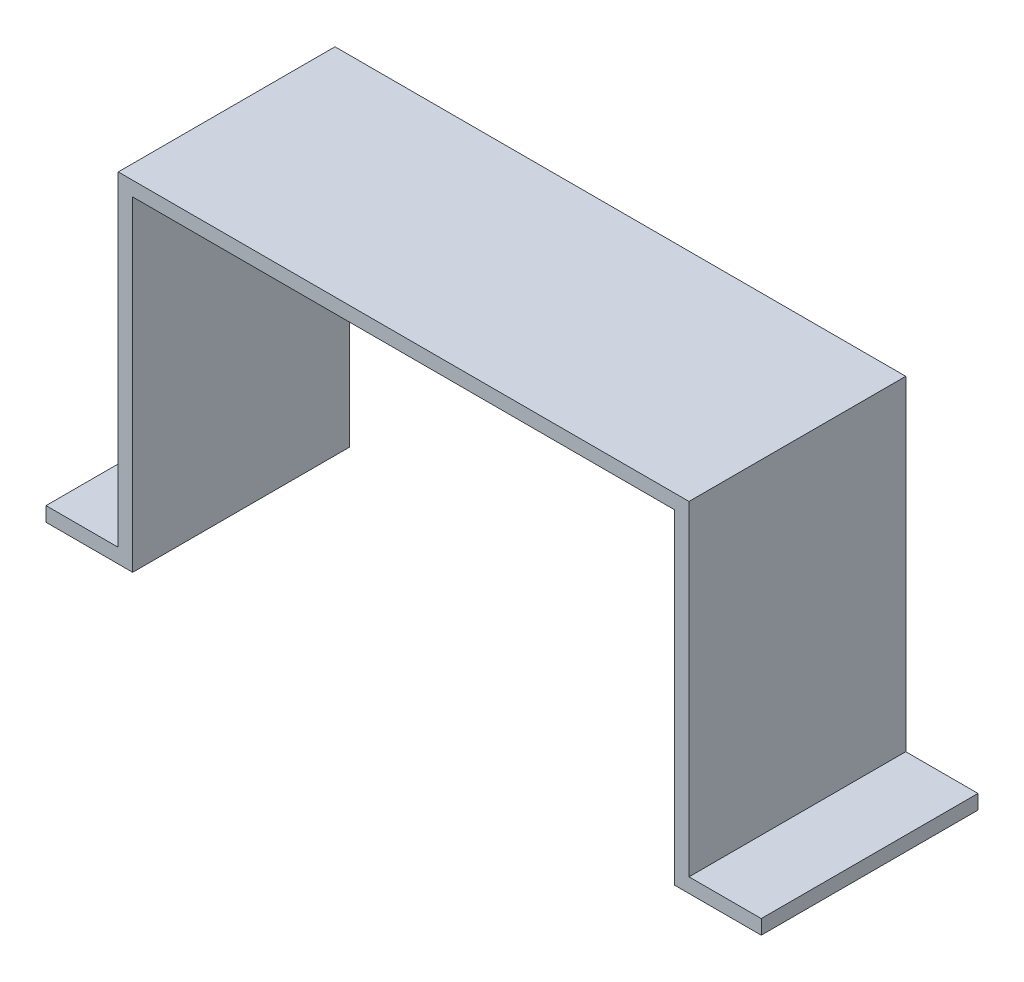
ISO-10303-21;
HEADER;
FILE_DESCRIPTION(('STEP AP214'),'2;1');
FILE_NAME('part.step','',(''),(''),'','','');
FILE_SCHEMA(('AUTOMOTIVE_DESIGN { 1 0 10303 214 1 1 1 1 }'));
ENDSEC;
DATA;
#1=APPLICATION_CONTEXT('core data for automotive mechanical design processes');
#2=APPLICATION_PROTOCOL_DEFINITION('international standard','automotive_design',2000,#1);
#3=PRODUCT_CONTEXT('',#1,'mechanical');
#4=PRODUCT('Part','Part','',(#3));
#5=PRODUCT_RELATED_PRODUCT_CATEGORY('part','',(#4));
#6=PRODUCT_DEFINITION_FORMATION('','',#4);
#7=PRODUCT_DEFINITION_CONTEXT('part definition',#1,'design');
#8=PRODUCT_DEFINITION('design','',#6,#7);
#9=PRODUCT_DEFINITION_SHAPE('','',#8);
#10=(LENGTH_UNIT() NAMED_UNIT(*) SI_UNIT(.MILLI.,.METRE.));
#11=(NAMED_UNIT(*) PLANE_ANGLE_UNIT() SI_UNIT($,.RADIAN.));
#12=(NAMED_UNIT(*) SI_UNIT($,.STERADIAN.) SOLID_ANGLE_UNIT());
#13=UNCERTAINTY_MEASURE_WITH_UNIT(LENGTH_MEASURE(1.E-05),#10,'distance_accuracy_value','');
#14=(GEOMETRIC_REPRESENTATION_CONTEXT(3) GLOBAL_UNCERTAINTY_ASSIGNED_CONTEXT((#13)) GLOBAL_UNIT_ASSIGNED_CONTEXT((#10,
#11,#12)) REPRESENTATION_CONTEXT('',''));
#15=CARTESIAN_POINT('',(0.,0.,0.));
#16=DIRECTION('',(0.,0.,1.));
#17=DIRECTION('',(1.,0.,0.));
#18=AXIS2_PLACEMENT_3D('',#15,#16,#17);
#19=CARTESIAN_POINT('',(39.5,23.5,30.));
#20=DIRECTION('',(-1.,0.,0.));
#21=DIRECTION('',(0.,0.,1.));
#22=AXIS2_PLACEMENT_3D('',#19,#20,#21);
#23=PLANE('',#22);
#24=DIRECTION('',(0.,0.,1.));
#25=VECTOR('',#24,1.);
#26=CARTESIAN_POINT('',(39.5,-21.5,0.));
#27=LINE('',#26,#25);
#28=CARTESIAN_POINT('',(39.5,-21.5,0.));
#29=VERTEX_POINT('',#28);
#30=CARTESIAN_POINT('',(39.5,-21.5,30.));
#31=VERTEX_POINT('',#30);
#32=EDGE_CURVE('E59',#29,#31,#27,.T.);
#33=ORIENTED_EDGE('',*,*,#32,.F.);
#34=DIRECTION('',(0.,1.,0.));
#35=VECTOR('',#34,1.);
#36=CARTESIAN_POINT('',(39.5,23.5,0.));
#37=LINE('',#36,#35);
#38=CARTESIAN_POINT('',(39.5,23.5,0.));
#39=VERTEX_POINT('',#38);
#40=EDGE_CURVE('E152',#29,#39,#37,.T.);
#41=ORIENTED_EDGE('',*,*,#40,.T.);
#42=DIRECTION('',(0.,0.,-1.));
#43=VECTOR('',#42,1.);
#44=CARTESIAN_POINT('',(39.5,23.5,30.));
#45=LINE('',#44,#43);
#46=CARTESIAN_POINT('',(39.5,23.5,30.));
#47=VERTEX_POINT('',#46);
#48=EDGE_CURVE('E11',#47,#39,#45,.T.);
#49=ORIENTED_EDGE('',*,*,#48,.F.);
#50=DIRECTION('',(0.,1.,0.));
#51=VECTOR('',#50,1.);
#52=CARTESIAN_POINT('',(39.5,23.5,30.));
#53=LINE('',#52,#51);
#54=EDGE_CURVE('E156',#31,#47,#53,.T.);
#55=ORIENTED_EDGE('',*,*,#54,.F.);
#56=EDGE_LOOP('',(#33,#41,#49,#55));
#57=FACE_BOUND('',#56,.T.);
#58=ADVANCED_FACE('F37',(#57),#23,.F.);
#59=CARTESIAN_POINT('',(-39.5,-23.5,30.));
#60=DIRECTION('',(0.,1.,0.));
#61=DIRECTION('',(0.,0.,1.));
#62=AXIS2_PLACEMENT_3D('',#59,#60,#61);
#63=PLANE('',#62);
#64=DIRECTION('',(1.,0.,0.));
#65=VECTOR('',#64,1.);
#66=CARTESIAN_POINT('',(-39.5,-23.5,0.));
#67=LINE('',#66,#65);
#68=CARTESIAN_POINT('',(-49.5,-23.5,0.));
#69=VERTEX_POINT('',#68);
#70=CARTESIAN_POINT('',(-37.5,-23.5,0.));
#71=VERTEX_POINT('',#70);
#72=EDGE_CURVE('E150',#69,#71,#67,.T.);
#73=ORIENTED_EDGE('',*,*,#72,.T.);
#74=DIRECTION('',(0.,0.,1.));
#75=VECTOR('',#74,1.);
#76=CARTESIAN_POINT('',(-37.5,-23.5,0.));
#77=LINE('',#76,#75);
#78=CARTESIAN_POINT('',(-37.5,-23.5,30.));
#79=VERTEX_POINT('',#78);
#80=EDGE_CURVE('E167',#71,#79,#77,.T.);
#81=ORIENTED_EDGE('',*,*,#80,.T.);
#82=DIRECTION('',(1.,0.,0.));
#83=VECTOR('',#82,1.);
#84=CARTESIAN_POINT('',(-39.5,-23.5,30.));
#85=LINE('',#84,#83);
#86=CARTESIAN_POINT('',(-49.5,-23.5,30.));
#87=VERTEX_POINT('',#86);
#88=EDGE_CURVE('E157',#87,#79,#85,.T.);
#89=ORIENTED_EDGE('',*,*,#88,.F.);
#90=DIRECTION('',(0.,0.,1.));
#91=VECTOR('',#90,1.);
#92=CARTESIAN_POINT('',(-49.5,-23.5,0.));
#93=LINE('',#92,#91);
#94=EDGE_CURVE('E192',#69,#87,#93,.T.);
#95=ORIENTED_EDGE('',*,*,#94,.F.);
#96=EDGE_LOOP('',(#73,#81,#89,#95));
#97=FACE_BOUND('',#96,.T.);
#98=ADVANCED_FACE('F252',(#97),#63,.F.);
#99=CARTESIAN_POINT('',(-39.5,23.5,30.));
#100=DIRECTION('',(0.,-1.,0.));
#101=DIRECTION('',(0.,0.,-1.));
#102=AXIS2_PLACEMENT_3D('',#99,#100,#101);
#103=PLANE('',#102);
#104=DIRECTION('',(-1.,0.,0.));
#105=VECTOR('',#104,1.);
#106=CARTESIAN_POINT('',(-39.5,23.5,0.));
#107=LINE('',#106,#105);
#108=CARTESIAN_POINT('',(-39.5,23.5,0.));
#109=VERTEX_POINT('',#108);
#110=EDGE_CURVE('E148',#39,#109,#107,.T.);
#111=ORIENTED_EDGE('',*,*,#110,.T.);
#112=DIRECTION('',(0.,0.,-1.));
#113=VECTOR('',#112,1.);
#114=CARTESIAN_POINT('',(-39.5,23.5,30.));
#115=LINE('',#114,#113);
#116=CARTESIAN_POINT('',(-39.5,23.5,30.));
#117=VERTEX_POINT('',#116);
#118=EDGE_CURVE('E44',#117,#109,#115,.T.);
#119=ORIENTED_EDGE('',*,*,#118,.F.);
#120=DIRECTION('',(-1.,0.,0.));
#121=VECTOR('',#120,1.);
#122=CARTESIAN_POINT('',(-39.5,23.5,30.));
#123=LINE('',#122,#121);
#124=EDGE_CURVE('E183',#47,#117,#123,.T.);
#125=ORIENTED_EDGE('',*,*,#124,.F.);
#126=ORIENTED_EDGE('',*,*,#48,.T.);
#127=EDGE_LOOP('',(#111,#119,#125,#126));
#128=FACE_BOUND('',#127,.T.);
#129=ADVANCED_FACE('F250',(#128),#103,.F.);
#130=CARTESIAN_POINT('',(-39.5,23.5,30.));
#131=DIRECTION('',(1.,0.,0.));
#132=DIRECTION('',(0.,0.,-1.));
#133=AXIS2_PLACEMENT_3D('',#130,#131,#132);
#134=PLANE('',#133);
#135=DIRECTION('',(0.,-1.,0.));
#136=VECTOR('',#135,1.);
#137=CARTESIAN_POINT('',(-39.5,23.5,0.));
#138=LINE('',#137,#136);
#139=CARTESIAN_POINT('',(-39.5,-21.5,0.));
#140=VERTEX_POINT('',#139);
#141=EDGE_CURVE('E140',#109,#140,#138,.T.);
#142=ORIENTED_EDGE('',*,*,#141,.T.);
#143=DIRECTION('',(0.,0.,1.));
#144=VECTOR('',#143,1.);
#145=CARTESIAN_POINT('',(-39.5,-21.5,0.));
#146=LINE('',#145,#144);
#147=CARTESIAN_POINT('',(-39.5,-21.5,30.));
#148=VERTEX_POINT('',#147);
#149=EDGE_CURVE('E123',#140,#148,#146,.T.);
#150=ORIENTED_EDGE('',*,*,#149,.T.);
#151=DIRECTION('',(0.,-1.,0.));
#152=VECTOR('',#151,1.);
#153=CARTESIAN_POINT('',(-39.5,23.5,30.));
#154=LINE('',#153,#152);
#155=EDGE_CURVE('E164',#117,#148,#154,.T.);
#156=ORIENTED_EDGE('',*,*,#155,.F.);
#157=ORIENTED_EDGE('',*,*,#118,.T.);
#158=EDGE_LOOP('',(#142,#150,#156,#157));
#159=FACE_BOUND('',#158,.T.);
#160=ADVANCED_FACE('F145',(#159),#134,.F.);
#161=CARTESIAN_POINT('',(37.5,-23.5,30.));
#162=VERTEX_POINT('',#161);
#163=CARTESIAN_POINT('',(49.5,-23.5,30.));
#164=VERTEX_POINT('',#163);
#165=EDGE_CURVE('E159',#162,#164,#85,.T.);
#166=ORIENTED_EDGE('',*,*,#165,.F.);
#167=DIRECTION('',(0.,0.,1.));
#168=VECTOR('',#167,1.);
#169=CARTESIAN_POINT('',(37.5,-23.5,0.));
#170=LINE('',#169,#168);
#171=CARTESIAN_POINT('',(37.5,-23.5,0.));
#172=VERTEX_POINT('',#171);
#173=EDGE_CURVE('E180',#172,#162,#170,.T.);
#174=ORIENTED_EDGE('',*,*,#173,.F.);
#175=CARTESIAN_POINT('',(49.5,-23.5,0.));
#176=VERTEX_POINT('',#175);
#177=EDGE_CURVE('E147',#172,#176,#67,.T.);
#178=ORIENTED_EDGE('',*,*,#177,.T.);
#179=DIRECTION('',(0.,0.,1.));
#180=VECTOR('',#179,1.);
#181=CARTESIAN_POINT('',(49.5,-23.5,0.));
#182=LINE('',#181,#180);
#183=EDGE_CURVE('E206',#176,#164,#182,.T.);
#184=ORIENTED_EDGE('',*,*,#183,.T.);
#185=EDGE_LOOP('',(#166,#174,#178,#184));
#186=FACE_BOUND('',#185,.T.);
#187=ADVANCED_FACE('F238',(#186),#63,.F.);
#188=CARTESIAN_POINT('',(0.,0.,30.));
#189=DIRECTION('',(0.,0.,1.));
#190=DIRECTION('',(1.,0.,0.));
#191=AXIS2_PLACEMENT_3D('',#188,#189,#190);
#192=PLANE('',#191);
#193=DIRECTION('',(0.,-1.,0.));
#194=VECTOR('',#193,1.);
#195=CARTESIAN_POINT('',(-37.5,-23.5,30.));
#196=LINE('',#195,#194);
#197=CARTESIAN_POINT('',(-37.5,21.5,30.));
#198=VERTEX_POINT('',#197);
#199=EDGE_CURVE('E176',#198,#79,#196,.T.);
#200=ORIENTED_EDGE('',*,*,#199,.F.);
#201=DIRECTION('',(-1.,0.,0.));
#202=VECTOR('',#201,1.);
#203=CARTESIAN_POINT('',(-37.5,21.5,30.));
#204=LINE('',#203,#202);
#205=CARTESIAN_POINT('',(37.5,21.5,30.));
#206=VERTEX_POINT('',#205);
#207=EDGE_CURVE('E225',#206,#198,#204,.T.);
#208=ORIENTED_EDGE('',*,*,#207,.F.);
#209=DIRECTION('',(0.,1.,0.));
#210=VECTOR('',#209,1.);
#211=CARTESIAN_POINT('',(37.5,21.5,30.));
#212=LINE('',#211,#210);
#213=EDGE_CURVE('E212',#162,#206,#212,.T.);
#214=ORIENTED_EDGE('',*,*,#213,.F.);
#215=ORIENTED_EDGE('',*,*,#165,.T.);
#216=DIRECTION('',(0.,1.,0.));
#217=VECTOR('',#216,1.);
#218=CARTESIAN_POINT('',(49.5,-23.5,30.));
#219=LINE('',#218,#217);
#220=CARTESIAN_POINT('',(49.5,-21.5,30.));
#221=VERTEX_POINT('',#220);
#222=EDGE_CURVE('E197',#164,#221,#219,.T.);
#223=ORIENTED_EDGE('',*,*,#222,.T.);
#224=DIRECTION('',(-1.,0.,0.));
#225=VECTOR('',#224,1.);
#226=CARTESIAN_POINT('',(49.5,-21.5,30.));
#227=LINE('',#226,#225);
#228=EDGE_CURVE('E203',#221,#31,#227,.T.);
#229=ORIENTED_EDGE('',*,*,#228,.T.);
#230=ORIENTED_EDGE('',*,*,#54,.T.);
#231=ORIENTED_EDGE('',*,*,#124,.T.);
#232=ORIENTED_EDGE('',*,*,#155,.T.);
#233=DIRECTION('',(-1.,0.,0.));
#234=VECTOR('',#233,1.);
#235=CARTESIAN_POINT('',(-39.5,-21.5,30.));
#236=LINE('',#235,#234);
#237=CARTESIAN_POINT('',(-49.5,-21.5,30.));
#238=VERTEX_POINT('',#237);
#239=EDGE_CURVE('E51',#148,#238,#236,.T.);
#240=ORIENTED_EDGE('',*,*,#239,.T.);
#241=DIRECTION('',(0.,-1.,0.));
#242=VECTOR('',#241,1.);
#243=CARTESIAN_POINT('',(-49.5,-21.5,30.));
#244=LINE('',#243,#242);
#245=EDGE_CURVE('E142',#238,#87,#244,.T.);
#246=ORIENTED_EDGE('',*,*,#245,.T.);
#247=ORIENTED_EDGE('',*,*,#88,.T.);
#248=EDGE_LOOP('',(#200,#208,#214,#215,#223,#229,#230,#231,#232,#240,#246,#247));
#249=FACE_BOUND('',#248,.T.);
#250=ADVANCED_FACE('F185',(#249),#192,.T.);
#251=CARTESIAN_POINT('',(0.,0.,0.));
#252=DIRECTION('',(0.,0.,1.));
#253=DIRECTION('',(1.,0.,0.));
#254=AXIS2_PLACEMENT_3D('',#251,#252,#253);
#255=PLANE('',#254);
#256=DIRECTION('',(-1.,0.,0.));
#257=VECTOR('',#256,1.);
#258=CARTESIAN_POINT('',(-37.5,21.5,0.));
#259=LINE('',#258,#257);
#260=CARTESIAN_POINT('',(37.5,21.5,0.));
#261=VERTEX_POINT('',#260);
#262=CARTESIAN_POINT('',(-37.5,21.5,0.));
#263=VERTEX_POINT('',#262);
#264=EDGE_CURVE('E220',#261,#263,#259,.T.);
#265=ORIENTED_EDGE('',*,*,#264,.T.);
#266=DIRECTION('',(0.,-1.,0.));
#267=VECTOR('',#266,1.);
#268=CARTESIAN_POINT('',(-37.5,-23.5,0.));
#269=LINE('',#268,#267);
#270=EDGE_CURVE('E182',#263,#71,#269,.T.);
#271=ORIENTED_EDGE('',*,*,#270,.T.);
#272=ORIENTED_EDGE('',*,*,#72,.F.);
#273=DIRECTION('',(0.,-1.,0.));
#274=VECTOR('',#273,1.);
#275=CARTESIAN_POINT('',(-49.5,-21.5,0.));
#276=LINE('',#275,#274);
#277=CARTESIAN_POINT('',(-49.5,-21.5,0.));
#278=VERTEX_POINT('',#277);
#279=EDGE_CURVE('E133',#278,#69,#276,.T.);
#280=ORIENTED_EDGE('',*,*,#279,.F.);
#281=DIRECTION('',(-1.,0.,0.));
#282=VECTOR('',#281,1.);
#283=CARTESIAN_POINT('',(-39.5,-21.5,0.));
#284=LINE('',#283,#282);
#285=EDGE_CURVE('E126',#140,#278,#284,.T.);
#286=ORIENTED_EDGE('',*,*,#285,.F.);
#287=ORIENTED_EDGE('',*,*,#141,.F.);
#288=ORIENTED_EDGE('',*,*,#110,.F.);
#289=ORIENTED_EDGE('',*,*,#40,.F.);
#290=DIRECTION('',(-1.,0.,0.));
#291=VECTOR('',#290,1.);
#292=CARTESIAN_POINT('',(49.5,-21.5,0.));
#293=LINE('',#292,#291);
#294=CARTESIAN_POINT('',(49.5,-21.5,0.));
#295=VERTEX_POINT('',#294);
#296=EDGE_CURVE('E202',#295,#29,#293,.T.);
#297=ORIENTED_EDGE('',*,*,#296,.F.);
#298=DIRECTION('',(0.,1.,0.));
#299=VECTOR('',#298,1.);
#300=CARTESIAN_POINT('',(49.5,-23.5,0.));
#301=LINE('',#300,#299);
#302=EDGE_CURVE('E199',#176,#295,#301,.T.);
#303=ORIENTED_EDGE('',*,*,#302,.F.);
#304=ORIENTED_EDGE('',*,*,#177,.F.);
#305=DIRECTION('',(0.,1.,0.));
#306=VECTOR('',#305,1.);
#307=CARTESIAN_POINT('',(37.5,21.5,0.));
#308=LINE('',#307,#306);
#309=EDGE_CURVE('E217',#172,#261,#308,.T.);
#310=ORIENTED_EDGE('',*,*,#309,.T.);
#311=EDGE_LOOP('',(#265,#271,#272,#280,#286,#287,#288,#289,#297,#303,#304,#310));
#312=FACE_BOUND('',#311,.T.);
#313=ADVANCED_FACE('F138',(#312),#255,.F.);
#314=CARTESIAN_POINT('',(-37.5,-23.5,0.));
#315=DIRECTION('',(-1.,0.,0.));
#316=DIRECTION('',(0.,0.,1.));
#317=AXIS2_PLACEMENT_3D('',#314,#315,#316);
#318=PLANE('',#317);
#319=ORIENTED_EDGE('',*,*,#199,.T.);
#320=ORIENTED_EDGE('',*,*,#80,.F.);
#321=ORIENTED_EDGE('',*,*,#270,.F.);
#322=DIRECTION('',(0.,0.,1.));
#323=VECTOR('',#322,1.);
#324=CARTESIAN_POINT('',(-37.5,21.5,0.));
#325=LINE('',#324,#323);
#326=EDGE_CURVE('E170',#263,#198,#325,.T.);
#327=ORIENTED_EDGE('',*,*,#326,.T.);
#328=EDGE_LOOP('',(#319,#320,#321,#327));
#329=FACE_BOUND('',#328,.T.);
#330=ADVANCED_FACE('F230',(#329),#318,.F.);
#331=CARTESIAN_POINT('',(-37.5,21.5,0.));
#332=DIRECTION('',(0.,1.,0.));
#333=DIRECTION('',(0.,0.,1.));
#334=AXIS2_PLACEMENT_3D('',#331,#332,#333);
#335=PLANE('',#334);
#336=ORIENTED_EDGE('',*,*,#207,.T.);
#337=ORIENTED_EDGE('',*,*,#326,.F.);
#338=ORIENTED_EDGE('',*,*,#264,.F.);
#339=DIRECTION('',(0.,0.,1.));
#340=VECTOR('',#339,1.);
#341=CARTESIAN_POINT('',(37.5,21.5,0.));
#342=LINE('',#341,#340);
#343=EDGE_CURVE('E173',#261,#206,#342,.T.);
#344=ORIENTED_EDGE('',*,*,#343,.T.);
#345=EDGE_LOOP('',(#336,#337,#338,#344));
#346=FACE_BOUND('',#345,.T.);
#347=ADVANCED_FACE('F283',(#346),#335,.F.);
#348=CARTESIAN_POINT('',(37.5,21.5,0.));
#349=DIRECTION('',(1.,0.,0.));
#350=DIRECTION('',(0.,0.,-1.));
#351=AXIS2_PLACEMENT_3D('',#348,#349,#350);
#352=PLANE('',#351);
#353=ORIENTED_EDGE('',*,*,#213,.T.);
#354=ORIENTED_EDGE('',*,*,#343,.F.);
#355=ORIENTED_EDGE('',*,*,#309,.F.);
#356=ORIENTED_EDGE('',*,*,#173,.T.);
#357=EDGE_LOOP('',(#353,#354,#355,#356));
#358=FACE_BOUND('',#357,.T.);
#359=ADVANCED_FACE('F294',(#358),#352,.F.);
#360=CARTESIAN_POINT('',(49.5,-21.5,0.));
#361=DIRECTION('',(0.,1.,0.));
#362=DIRECTION('',(-1.,0.,0.));
#363=AXIS2_PLACEMENT_3D('',#360,#361,#362);
#364=PLANE('',#363);
#365=ORIENTED_EDGE('',*,*,#228,.F.);
#366=DIRECTION('',(0.,0.,1.));
#367=VECTOR('',#366,1.);
#368=CARTESIAN_POINT('',(49.5,-21.5,0.));
#369=LINE('',#368,#367);
#370=EDGE_CURVE('E213',#295,#221,#369,.T.);
#371=ORIENTED_EDGE('',*,*,#370,.F.);
#372=ORIENTED_EDGE('',*,*,#296,.T.);
#373=ORIENTED_EDGE('',*,*,#32,.T.);
#374=EDGE_LOOP('',(#365,#371,#372,#373));
#375=FACE_BOUND('',#374,.T.);
#376=ADVANCED_FACE('F247',(#375),#364,.T.);
#377=CARTESIAN_POINT('',(49.5,-23.5,0.));
#378=DIRECTION('',(1.,0.,0.));
#379=DIRECTION('',(0.,0.,-1.));
#380=AXIS2_PLACEMENT_3D('',#377,#378,#379);
#381=PLANE('',#380);
#382=ORIENTED_EDGE('',*,*,#222,.F.);
#383=ORIENTED_EDGE('',*,*,#183,.F.);
#384=ORIENTED_EDGE('',*,*,#302,.T.);
#385=ORIENTED_EDGE('',*,*,#370,.T.);
#386=EDGE_LOOP('',(#382,#383,#384,#385));
#387=FACE_BOUND('',#386,.T.);
#388=ADVANCED_FACE('F244',(#387),#381,.T.);
#389=CARTESIAN_POINT('',(-49.5,-21.5,0.));
#390=DIRECTION('',(-1.,0.,0.));
#391=DIRECTION('',(0.,0.,1.));
#392=AXIS2_PLACEMENT_3D('',#389,#390,#391);
#393=PLANE('',#392);
#394=ORIENTED_EDGE('',*,*,#245,.F.);
#395=DIRECTION('',(0.,0.,1.));
#396=VECTOR('',#395,1.);
#397=CARTESIAN_POINT('',(-49.5,-21.5,0.));
#398=LINE('',#397,#396);
#399=EDGE_CURVE('E132',#278,#238,#398,.T.);
#400=ORIENTED_EDGE('',*,*,#399,.F.);
#401=ORIENTED_EDGE('',*,*,#279,.T.);
#402=ORIENTED_EDGE('',*,*,#94,.T.);
#403=EDGE_LOOP('',(#394,#400,#401,#402));
#404=FACE_BOUND('',#403,.T.);
#405=ADVANCED_FACE('F190',(#404),#393,.T.);
#406=CARTESIAN_POINT('',(-39.5,-21.5,0.));
#407=DIRECTION('',(0.,1.,0.));
#408=DIRECTION('',(-1.,0.,0.));
#409=AXIS2_PLACEMENT_3D('',#406,#407,#408);
#410=PLANE('',#409);
#411=ORIENTED_EDGE('',*,*,#239,.F.);
#412=ORIENTED_EDGE('',*,*,#149,.F.);
#413=ORIENTED_EDGE('',*,*,#285,.T.);
#414=ORIENTED_EDGE('',*,*,#399,.T.);
#415=EDGE_LOOP('',(#411,#412,#413,#414));
#416=FACE_BOUND('',#415,.T.);
#417=ADVANCED_FACE('F125',(#416),#410,.T.);
#418=CLOSED_SHELL('',(#58,#98,#129,#160,#187,#250,#313,#330,#347,#359,#376,#388,#405,#417));
#419=MANIFOLD_SOLID_BREP('B2',#418);
#420=ADVANCED_BREP_SHAPE_REPRESENTATION('',(#18,#419),#14);
#421=SHAPE_DEFINITION_REPRESENTATION(#9,#420);
ENDSEC;
END-ISO-10303-21;
